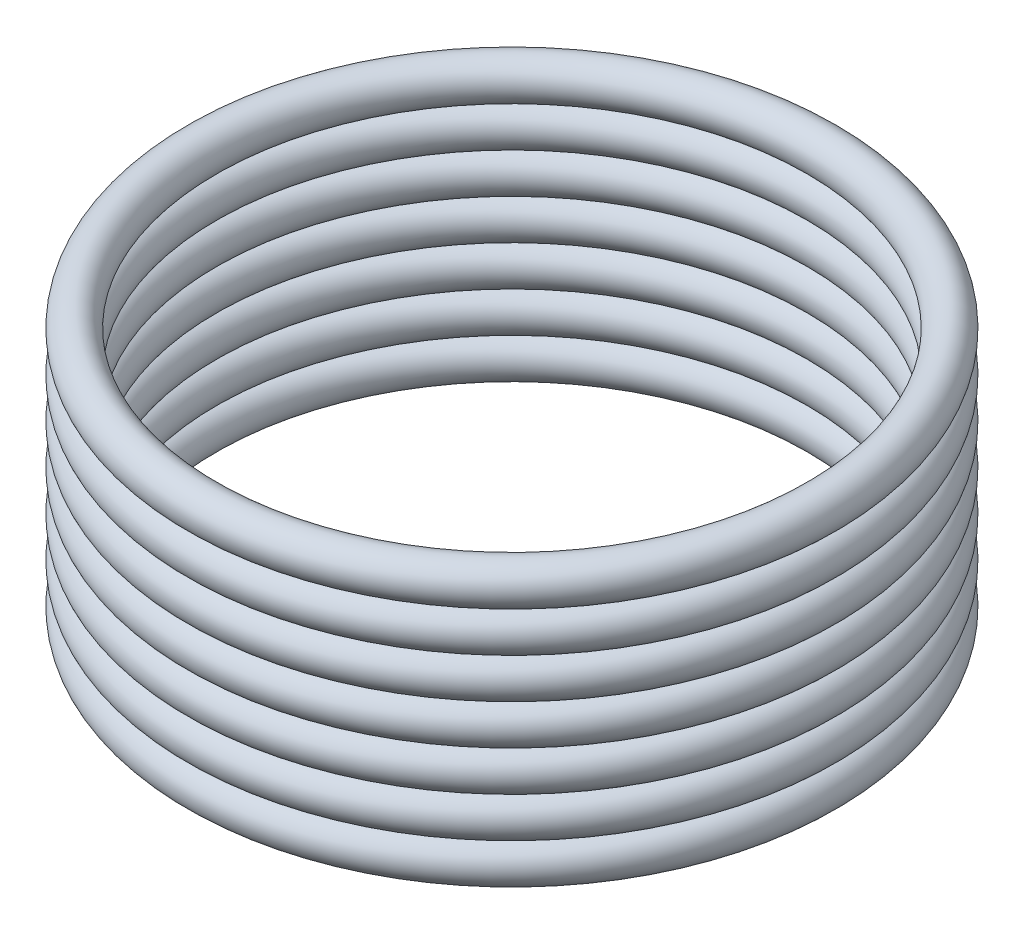
ISO-10303-21;
HEADER;
FILE_DESCRIPTION(('STEP AP214'),'2;1');
FILE_NAME('part.step','',(''),(''),'','','');
FILE_SCHEMA(('AUTOMOTIVE_DESIGN { 1 0 10303 214 1 1 1 1 }'));
ENDSEC;
DATA;
#1=APPLICATION_CONTEXT('core data for automotive mechanical design processes');
#2=APPLICATION_PROTOCOL_DEFINITION('international standard','automotive_design',2000,#1);
#3=PRODUCT_CONTEXT('',#1,'mechanical');
#4=PRODUCT('Part','Part','',(#3));
#5=PRODUCT_RELATED_PRODUCT_CATEGORY('part','',(#4));
#6=PRODUCT_DEFINITION_FORMATION('','',#4);
#7=PRODUCT_DEFINITION_CONTEXT('part definition',#1,'design');
#8=PRODUCT_DEFINITION('design','',#6,#7);
#9=PRODUCT_DEFINITION_SHAPE('','',#8);
#10=(LENGTH_UNIT() NAMED_UNIT(*) SI_UNIT(.MILLI.,.METRE.));
#11=(NAMED_UNIT(*) PLANE_ANGLE_UNIT() SI_UNIT($,.RADIAN.));
#12=(NAMED_UNIT(*) SI_UNIT($,.STERADIAN.) SOLID_ANGLE_UNIT());
#13=UNCERTAINTY_MEASURE_WITH_UNIT(LENGTH_MEASURE(1.E-05),#10,'distance_accuracy_value','');
#14=(GEOMETRIC_REPRESENTATION_CONTEXT(3) GLOBAL_UNCERTAINTY_ASSIGNED_CONTEXT((#13)) GLOBAL_UNIT_ASSIGNED_CONTEXT((#10,
#11,#12)) REPRESENTATION_CONTEXT('',''));
#15=CARTESIAN_POINT('',(0.,0.,0.));
#16=DIRECTION('',(0.,0.,1.));
#17=DIRECTION('',(1.,0.,0.));
#18=AXIS2_PLACEMENT_3D('',#15,#16,#17);
#19=CARTESIAN_POINT('',(0.,84.,0.));
#20=DIRECTION('',(0.,-1.,0.));
#21=DIRECTION('',(0.,0.,-1.));
#22=AXIS2_PLACEMENT_3D('',#19,#20,#21);
#23=TOROIDAL_SURFACE('',#22,108.,7.);
#24=CARTESIAN_POINT('',(0.,84.,-115.));
#25=VERTEX_POINT('',#24);
#26=VERTEX_LOOP('',#25);
#27=FACE_BOUND('',#26,.T.);
#28=ADVANCED_FACE('F40',(#27),#23,.T.);
#29=CLOSED_SHELL('',(#28));
#30=MANIFOLD_SOLID_BREP('B2',#29);
#31=CARTESIAN_POINT('',(0.,70.,0.));
#32=DIRECTION('',(0.,-1.,0.));
#33=DIRECTION('',(0.,0.,-1.));
#34=AXIS2_PLACEMENT_3D('',#31,#32,#33);
#35=TOROIDAL_SURFACE('',#34,108.,7.);
#36=CARTESIAN_POINT('',(0.,70.,-115.));
#37=VERTEX_POINT('',#36);
#38=VERTEX_LOOP('',#37);
#39=FACE_BOUND('',#38,.T.);
#40=ADVANCED_FACE('F59',(#39),#35,.T.);
#41=CLOSED_SHELL('',(#40));
#42=MANIFOLD_SOLID_BREP('B6',#41);
#43=CARTESIAN_POINT('',(0.,56.,0.));
#44=DIRECTION('',(0.,-1.,0.));
#45=DIRECTION('',(0.,0.,-1.));
#46=AXIS2_PLACEMENT_3D('',#43,#44,#45);
#47=TOROIDAL_SURFACE('',#46,108.,7.);
#48=CARTESIAN_POINT('',(0.,56.,-115.));
#49=VERTEX_POINT('',#48);
#50=VERTEX_LOOP('',#49);
#51=FACE_BOUND('',#50,.T.);
#52=ADVANCED_FACE('F76',(#51),#47,.T.);
#53=CLOSED_SHELL('',(#52));
#54=MANIFOLD_SOLID_BREP('B36',#53);
#55=CARTESIAN_POINT('',(0.,42.,0.));
#56=DIRECTION('',(0.,-1.,0.));
#57=DIRECTION('',(0.,0.,-1.));
#58=AXIS2_PLACEMENT_3D('',#55,#56,#57);
#59=TOROIDAL_SURFACE('',#58,108.,7.);
#60=CARTESIAN_POINT('',(0.,42.,-115.));
#61=VERTEX_POINT('',#60);
#62=VERTEX_LOOP('',#61);
#63=FACE_BOUND('',#62,.T.);
#64=ADVANCED_FACE('F93',(#63),#59,.T.);
#65=CLOSED_SHELL('',(#64));
#66=MANIFOLD_SOLID_BREP('B55',#65);
#67=CARTESIAN_POINT('',(0.,28.,0.));
#68=DIRECTION('',(0.,-1.,0.));
#69=DIRECTION('',(0.,0.,-1.));
#70=AXIS2_PLACEMENT_3D('',#67,#68,#69);
#71=TOROIDAL_SURFACE('',#70,108.,7.);
#72=CARTESIAN_POINT('',(0.,28.,-115.));
#73=VERTEX_POINT('',#72);
#74=VERTEX_LOOP('',#73);
#75=FACE_BOUND('',#74,.T.);
#76=ADVANCED_FACE('F110',(#75),#71,.T.);
#77=CLOSED_SHELL('',(#76));
#78=MANIFOLD_SOLID_BREP('B72',#77);
#79=CARTESIAN_POINT('',(0.,14.,0.));
#80=DIRECTION('',(0.,-1.,0.));
#81=DIRECTION('',(0.,0.,-1.));
#82=AXIS2_PLACEMENT_3D('',#79,#80,#81);
#83=TOROIDAL_SURFACE('',#82,108.,7.);
#84=CARTESIAN_POINT('',(0.,14.,-115.));
#85=VERTEX_POINT('',#84);
#86=VERTEX_LOOP('',#85);
#87=FACE_BOUND('',#86,.T.);
#88=ADVANCED_FACE('F125',(#87),#83,.T.);
#89=CLOSED_SHELL('',(#88));
#90=MANIFOLD_SOLID_BREP('B89',#89);
#91=CARTESIAN_POINT('',(0.,0.,0.));
#92=DIRECTION('',(0.,-1.,0.));
#93=DIRECTION('',(0.,0.,-1.));
#94=AXIS2_PLACEMENT_3D('',#91,#92,#93);
#95=TOROIDAL_SURFACE('',#94,108.,7.);
#96=CARTESIAN_POINT('',(0.,0.,-115.));
#97=VERTEX_POINT('',#96);
#98=VERTEX_LOOP('',#97);
#99=FACE_BOUND('',#98,.T.);
#100=ADVANCED_FACE('F135',(#99),#95,.T.);
#101=CLOSED_SHELL('',(#100));
#102=MANIFOLD_SOLID_BREP('B106',#101);
#103=ADVANCED_BREP_SHAPE_REPRESENTATION('',(#18,#30,#42,#54,#66,#78,#90,#102),#14);
#104=SHAPE_DEFINITION_REPRESENTATION(#9,#103);
ENDSEC;
END-ISO-10303-21;
